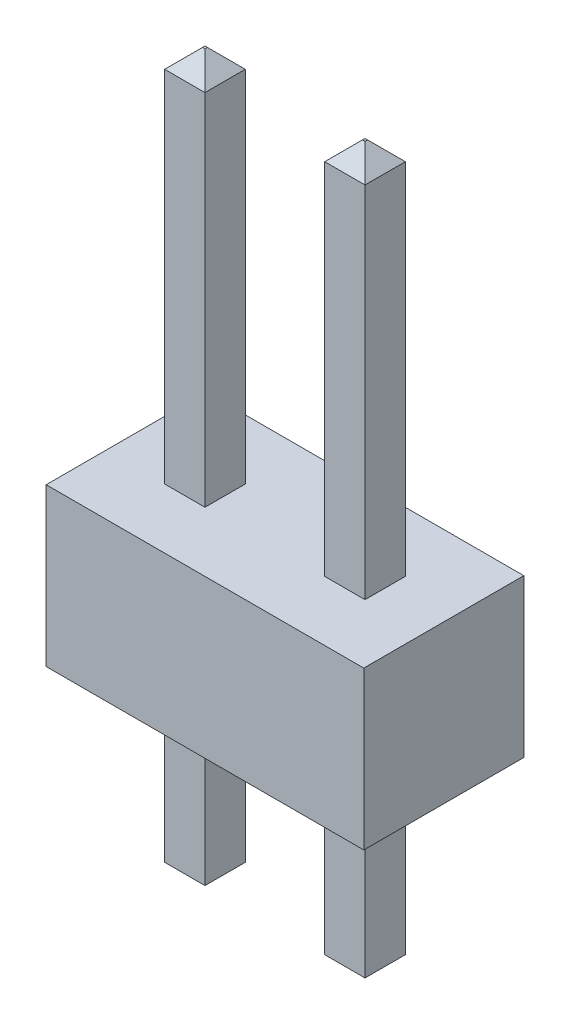
ISO-10303-21;
HEADER;
FILE_DESCRIPTION(('STEP AP214'),'2;1');
FILE_NAME('part.step','',(''),(''),'','','');
FILE_SCHEMA(('AUTOMOTIVE_DESIGN { 1 0 10303 214 1 1 1 1 }'));
ENDSEC;
DATA;
#1=APPLICATION_CONTEXT('core data for automotive mechanical design processes');
#2=APPLICATION_PROTOCOL_DEFINITION('international standard','automotive_design',2000,#1);
#3=PRODUCT_CONTEXT('',#1,'mechanical');
#4=PRODUCT('Part','Part','',(#3));
#5=PRODUCT_RELATED_PRODUCT_CATEGORY('part','',(#4));
#6=PRODUCT_DEFINITION_FORMATION('','',#4);
#7=PRODUCT_DEFINITION_CONTEXT('part definition',#1,'design');
#8=PRODUCT_DEFINITION('design','',#6,#7);
#9=PRODUCT_DEFINITION_SHAPE('','',#8);
#10=(LENGTH_UNIT() NAMED_UNIT(*) SI_UNIT(.MILLI.,.METRE.));
#11=(NAMED_UNIT(*) PLANE_ANGLE_UNIT() SI_UNIT($,.RADIAN.));
#12=(NAMED_UNIT(*) SI_UNIT($,.STERADIAN.) SOLID_ANGLE_UNIT());
#13=UNCERTAINTY_MEASURE_WITH_UNIT(LENGTH_MEASURE(1.E-05),#10,'distance_accuracy_value','');
#14=(GEOMETRIC_REPRESENTATION_CONTEXT(3) GLOBAL_UNCERTAINTY_ASSIGNED_CONTEXT((#13)) GLOBAL_UNIT_ASSIGNED_CONTEXT((#10,
#11,#12)) REPRESENTATION_CONTEXT('',''));
#15=CARTESIAN_POINT('',(0.,0.,0.));
#16=DIRECTION('',(0.,0.,1.));
#17=DIRECTION('',(1.,0.,0.));
#18=AXIS2_PLACEMENT_3D('',#15,#16,#17);
#19=CARTESIAN_POINT('',(1.23000000000001,-3.,1.59000000000001));
#20=DIRECTION('',(0.707106781186548,0.707106781186548,0.));
#21=DIRECTION('',(-0.707106781186548,0.707106781186548,0.));
#22=AXIS2_PLACEMENT_3D('',#19,#20,#21);
#23=PLANE('',#22);
#24=DIRECTION('',(0.,0.,-1.));
#25=VECTOR('',#24,1.);
#26=CARTESIAN_POINT('',(0.929999999999986,-2.7,0.950000000000006));
#27=LINE('',#26,#25);
#28=CARTESIAN_POINT('',(0.929999999999986,-2.7,1.58999999999998));
#29=VERTEX_POINT('',#28);
#30=CARTESIAN_POINT('',(0.929999999999986,-2.7,0.950000000000006));
#31=VERTEX_POINT('',#30);
#32=EDGE_CURVE('E444',#29,#31,#27,.T.);
#33=ORIENTED_EDGE('',*,*,#32,.T.);
#34=DIRECTION('',(0.577350269189625,-0.577350269189625,0.577350269189627));
#35=VECTOR('',#34,1.);
#36=CARTESIAN_POINT('',(0.929999999999986,-2.7,0.950000000000006));
#37=LINE('',#36,#35);
#38=CARTESIAN_POINT('',(1.22999999999998,-3.,1.24999999999997));
#39=VERTEX_POINT('',#38);
#40=EDGE_CURVE('E213',#31,#39,#37,.T.);
#41=ORIENTED_EDGE('',*,*,#40,.T.);
#42=DIRECTION('',(0.,0.,1.));
#43=VECTOR('',#42,1.);
#44=CARTESIAN_POINT('',(1.23000000000001,-3.,1.59000000000001));
#45=LINE('',#44,#43);
#46=CARTESIAN_POINT('',(1.22999999999998,-3.,1.29000000000004));
#47=VERTEX_POINT('',#46);
#48=EDGE_CURVE('E455',#39,#47,#45,.T.);
#49=ORIENTED_EDGE('',*,*,#48,.T.);
#50=DIRECTION('',(-0.577350269189625,0.577350269189626,0.577350269189627));
#51=VECTOR('',#50,1.);
#52=CARTESIAN_POINT('',(1.22999999999998,-3.,1.29000000000004));
#53=LINE('',#52,#51);
#54=EDGE_CURVE('E449',#47,#29,#53,.T.);
#55=ORIENTED_EDGE('',*,*,#54,.T.);
#56=EDGE_LOOP('',(#33,#41,#49,#55));
#57=FACE_BOUND('',#56,.T.);
#58=ADVANCED_FACE('F32',(#57),#23,.F.);
#59=CARTESIAN_POINT('',(3.77,-3.,1.58999999999998));
#60=DIRECTION('',(0.707106781186548,0.707106781186548,0.));
#61=DIRECTION('',(-0.707106781186548,0.707106781186548,0.));
#62=AXIS2_PLACEMENT_3D('',#59,#60,#61);
#63=PLANE('',#62);
#64=DIRECTION('',(0.,0.,-1.));
#65=VECTOR('',#64,1.);
#66=CARTESIAN_POINT('',(3.46999999999997,-2.7,0.950000000000034));
#67=LINE('',#66,#65);
#68=CARTESIAN_POINT('',(3.47,-2.7,1.59000000000004));
#69=VERTEX_POINT('',#68);
#70=CARTESIAN_POINT('',(3.46999999999997,-2.7,0.950000000000034));
#71=VERTEX_POINT('',#70);
#72=EDGE_CURVE('E423',#69,#71,#67,.T.);
#73=ORIENTED_EDGE('',*,*,#72,.T.);
#74=DIRECTION('',(0.577350269189626,-0.577350269189625,0.577350269189627));
#75=VECTOR('',#74,1.);
#76=CARTESIAN_POINT('',(3.46999999999997,-2.7,0.950000000000034));
#77=LINE('',#76,#75);
#78=CARTESIAN_POINT('',(3.77,-3.,1.24999999999999));
#79=VERTEX_POINT('',#78);
#80=EDGE_CURVE('E438',#71,#79,#77,.T.);
#81=ORIENTED_EDGE('',*,*,#80,.T.);
#82=DIRECTION('',(0.,0.,1.));
#83=VECTOR('',#82,1.);
#84=CARTESIAN_POINT('',(3.77,-3.,1.58999999999998));
#85=LINE('',#84,#83);
#86=CARTESIAN_POINT('',(3.77,-3.,1.29000000000004));
#87=VERTEX_POINT('',#86);
#88=EDGE_CURVE('E442',#79,#87,#85,.T.);
#89=ORIENTED_EDGE('',*,*,#88,.T.);
#90=DIRECTION('',(-0.577350269189626,0.577350269189626,0.577350269189626));
#91=VECTOR('',#90,1.);
#92=CARTESIAN_POINT('',(3.77,-3.,1.29000000000004));
#93=LINE('',#92,#91);
#94=EDGE_CURVE('E429',#87,#69,#93,.T.);
#95=ORIENTED_EDGE('',*,*,#94,.T.);
#96=EDGE_LOOP('',(#73,#81,#89,#95));
#97=FACE_BOUND('',#96,.T.);
#98=ADVANCED_FACE('F484',(#97),#63,.F.);
#99=CARTESIAN_POINT('',(1.56999999999996,-3.,1.25000000000003));
#100=DIRECTION('',(0.,0.707106781186548,0.707106781186547));
#101=DIRECTION('',(0.,-0.707106781186547,0.707106781186548));
#102=AXIS2_PLACEMENT_3D('',#99,#100,#101);
#103=PLANE('',#102);
#104=DIRECTION('',(1.,0.,0.));
#105=VECTOR('',#104,1.);
#106=CARTESIAN_POINT('',(0.929999999999986,-2.7,0.950000000000006));
#107=LINE('',#106,#105);
#108=CARTESIAN_POINT('',(1.56999999999999,-2.7,0.95));
#109=VERTEX_POINT('',#108);
#110=EDGE_CURVE('E411',#31,#109,#107,.T.);
#111=ORIENTED_EDGE('',*,*,#110,.T.);
#112=DIRECTION('',(-0.577350269189627,-0.577350269189626,0.577350269189625));
#113=VECTOR('',#112,1.);
#114=CARTESIAN_POINT('',(1.56999999999999,-2.7,0.95));
#115=LINE('',#114,#113);
#116=CARTESIAN_POINT('',(1.26999999999999,-3.,1.25000000000001));
#117=VERTEX_POINT('',#116);
#118=EDGE_CURVE('E408',#109,#117,#115,.T.);
#119=ORIENTED_EDGE('',*,*,#118,.T.);
#120=DIRECTION('',(1.,0.,0.));
#121=VECTOR('',#120,1.);
#122=CARTESIAN_POINT('',(1.56999999999996,-3.,1.25000000000003));
#123=LINE('',#122,#121);
#124=EDGE_CURVE('E457',#117,#39,#123,.F.);
#125=ORIENTED_EDGE('',*,*,#124,.T.);
#126=ORIENTED_EDGE('',*,*,#40,.F.);
#127=EDGE_LOOP('',(#111,#119,#125,#126));
#128=FACE_BOUND('',#127,.T.);
#129=ADVANCED_FACE('F460',(#128),#103,.F.);
#130=CARTESIAN_POINT('',(1.57000000000002,-3.,1.59000000000004));
#131=DIRECTION('',(0.,1.,0.));
#132=DIRECTION('',(0.,0.,1.));
#133=AXIS2_PLACEMENT_3D('',#130,#131,#132);
#134=PLANE('',#133);
#135=ORIENTED_EDGE('',*,*,#124,.F.);
#136=DIRECTION('',(0.,0.,1.));
#137=VECTOR('',#136,1.);
#138=CARTESIAN_POINT('',(1.26999999999999,-3.,1.58999999999998));
#139=LINE('',#138,#137);
#140=CARTESIAN_POINT('',(1.26999999999999,-3.,1.29000000000005));
#141=VERTEX_POINT('',#140);
#142=EDGE_CURVE('E405',#117,#141,#139,.T.);
#143=ORIENTED_EDGE('',*,*,#142,.T.);
#144=DIRECTION('',(1.,0.,0.));
#145=VECTOR('',#144,1.);
#146=CARTESIAN_POINT('',(1.56999999999999,-3.,1.28999999999999));
#147=LINE('',#146,#145);
#148=EDGE_CURVE('E452',#141,#47,#147,.F.);
#149=ORIENTED_EDGE('',*,*,#148,.T.);
#150=ORIENTED_EDGE('',*,*,#48,.F.);
#151=EDGE_LOOP('',(#135,#143,#149,#150));
#152=FACE_BOUND('',#151,.T.);
#153=ADVANCED_FACE('F463',(#152),#134,.F.);
#154=CARTESIAN_POINT('',(1.56999999999999,-3.,1.28999999999999));
#155=DIRECTION('',(0.,0.707106781186548,-0.707106781186548));
#156=DIRECTION('',(0.,0.707106781186548,0.707106781186548));
#157=AXIS2_PLACEMENT_3D('',#154,#155,#156);
#158=PLANE('',#157);
#159=DIRECTION('',(-1.,0.,0.));
#160=VECTOR('',#159,1.);
#161=CARTESIAN_POINT('',(0.929999999999986,-2.7,1.58999999999998));
#162=LINE('',#161,#160);
#163=CARTESIAN_POINT('',(1.57000000000002,-2.7,1.59000000000004));
#164=VERTEX_POINT('',#163);
#165=EDGE_CURVE('E397',#164,#29,#162,.T.);
#166=ORIENTED_EDGE('',*,*,#165,.T.);
#167=ORIENTED_EDGE('',*,*,#54,.F.);
#168=ORIENTED_EDGE('',*,*,#148,.F.);
#169=DIRECTION('',(0.577350269189626,0.577350269189626,0.577350269189627));
#170=VECTOR('',#169,1.);
#171=CARTESIAN_POINT('',(1.26999999999999,-3.,1.29000000000005));
#172=LINE('',#171,#170);
#173=EDGE_CURVE('E402',#141,#164,#172,.T.);
#174=ORIENTED_EDGE('',*,*,#173,.T.);
#175=EDGE_LOOP('',(#166,#167,#168,#174));
#176=FACE_BOUND('',#175,.T.);
#177=ADVANCED_FACE('F470',(#176),#158,.F.);
#178=CARTESIAN_POINT('',(0.929999999999986,-3.,0.950000000000006));
#179=DIRECTION('',(1.,0.,0.));
#180=DIRECTION('',(0.,0.,-1.));
#181=AXIS2_PLACEMENT_3D('',#178,#179,#180);
#182=PLANE('',#181);
#183=ORIENTED_EDGE('',*,*,#32,.F.);
#184=DIRECTION('',(0.,1.,0.));
#185=VECTOR('',#184,1.);
#186=CARTESIAN_POINT('',(0.929999999999986,-3.,1.58999999999998));
#187=LINE('',#186,#185);
#188=CARTESIAN_POINT('',(0.929999999999986,0.,1.58999999999998));
#189=VERTEX_POINT('',#188);
#190=EDGE_CURVE('E394',#29,#189,#187,.T.);
#191=ORIENTED_EDGE('',*,*,#190,.T.);
#192=DIRECTION('',(0.,0.,-1.));
#193=VECTOR('',#192,1.);
#194=CARTESIAN_POINT('',(0.929999999999986,0.,0.950000000000006));
#195=LINE('',#194,#193);
#196=CARTESIAN_POINT('',(0.929999999999986,0.,0.950000000000006));
#197=VERTEX_POINT('',#196);
#198=EDGE_CURVE('E446',#197,#189,#195,.F.);
#199=ORIENTED_EDGE('',*,*,#198,.F.);
#200=DIRECTION('',(0.,1.,0.));
#201=VECTOR('',#200,1.);
#202=CARTESIAN_POINT('',(0.929999999999986,-3.,0.950000000000006));
#203=LINE('',#202,#201);
#204=EDGE_CURVE('E415',#197,#31,#203,.F.);
#205=ORIENTED_EDGE('',*,*,#204,.T.);
#206=EDGE_LOOP('',(#183,#191,#199,#205));
#207=FACE_BOUND('',#206,.T.);
#208=ADVANCED_FACE('F480',(#207),#182,.F.);
#209=CARTESIAN_POINT('',(4.10999999999997,-3.,1.59000000000001));
#210=DIRECTION('',(0.,1.,0.));
#211=DIRECTION('',(0.,0.,1.));
#212=AXIS2_PLACEMENT_3D('',#209,#210,#211);
#213=PLANE('',#212);
#214=ORIENTED_EDGE('',*,*,#88,.F.);
#215=DIRECTION('',(1.,0.,0.));
#216=VECTOR('',#215,1.);
#217=CARTESIAN_POINT('',(4.11,-3.,1.25000000000002));
#218=LINE('',#217,#216);
#219=CARTESIAN_POINT('',(3.80999999999998,-3.,1.24999999999997));
#220=VERTEX_POINT('',#219);
#221=EDGE_CURVE('E435',#79,#220,#218,.T.);
#222=ORIENTED_EDGE('',*,*,#221,.T.);
#223=DIRECTION('',(0.,0.,1.));
#224=VECTOR('',#223,1.);
#225=CARTESIAN_POINT('',(3.81000000000001,-3.,1.58999999999999));
#226=LINE('',#225,#224);
#227=CARTESIAN_POINT('',(3.80999999999998,-3.,1.28999999999999));
#228=VERTEX_POINT('',#227);
#229=EDGE_CURVE('E380',#220,#228,#226,.T.);
#230=ORIENTED_EDGE('',*,*,#229,.T.);
#231=DIRECTION('',(1.,0.,0.));
#232=VECTOR('',#231,1.);
#233=CARTESIAN_POINT('',(4.11,-3.,1.29000000000003));
#234=LINE('',#233,#232);
#235=EDGE_CURVE('E432',#228,#87,#234,.F.);
#236=ORIENTED_EDGE('',*,*,#235,.T.);
#237=EDGE_LOOP('',(#214,#222,#230,#236));
#238=FACE_BOUND('',#237,.T.);
#239=ADVANCED_FACE('F620',(#238),#213,.F.);
#240=CARTESIAN_POINT('',(4.11,-3.,1.25000000000002));
#241=DIRECTION('',(0.,0.707106781186548,0.707106781186547));
#242=DIRECTION('',(0.,-0.707106781186547,0.707106781186548));
#243=AXIS2_PLACEMENT_3D('',#240,#241,#242);
#244=PLANE('',#243);
#245=ORIENTED_EDGE('',*,*,#221,.F.);
#246=ORIENTED_EDGE('',*,*,#80,.F.);
#247=DIRECTION('',(1.,0.,0.));
#248=VECTOR('',#247,1.);
#249=CARTESIAN_POINT('',(3.46999999999997,-2.7,0.950000000000034));
#250=LINE('',#249,#248);
#251=CARTESIAN_POINT('',(4.11,-2.7,0.949999999999979));
#252=VERTEX_POINT('',#251);
#253=EDGE_CURVE('E383',#71,#252,#250,.T.);
#254=ORIENTED_EDGE('',*,*,#253,.T.);
#255=DIRECTION('',(-0.577350269189627,-0.577350269189627,0.577350269189624));
#256=VECTOR('',#255,1.);
#257=CARTESIAN_POINT('',(4.11,-2.7,0.949999999999979));
#258=LINE('',#257,#256);
#259=EDGE_CURVE('E374',#252,#220,#258,.T.);
#260=ORIENTED_EDGE('',*,*,#259,.T.);
#261=EDGE_LOOP('',(#245,#246,#254,#260));
#262=FACE_BOUND('',#261,.T.);
#263=ADVANCED_FACE('F616',(#262),#244,.F.);
#264=CARTESIAN_POINT('',(4.11,-3.,1.29000000000003));
#265=DIRECTION('',(0.,0.707106781186548,-0.707106781186548));
#266=DIRECTION('',(0.,0.707106781186548,0.707106781186548));
#267=AXIS2_PLACEMENT_3D('',#264,#265,#266);
#268=PLANE('',#267);
#269=DIRECTION('',(-1.,0.,0.));
#270=VECTOR('',#269,1.);
#271=CARTESIAN_POINT('',(3.47,-2.7,1.59000000000004));
#272=LINE('',#271,#270);
#273=CARTESIAN_POINT('',(4.10999999999997,-2.7,1.59000000000001));
#274=VERTEX_POINT('',#273);
#275=EDGE_CURVE('E368',#274,#69,#272,.T.);
#276=ORIENTED_EDGE('',*,*,#275,.T.);
#277=ORIENTED_EDGE('',*,*,#94,.F.);
#278=ORIENTED_EDGE('',*,*,#235,.F.);
#279=DIRECTION('',(0.577350269189626,0.577350269189626,0.577350269189625));
#280=VECTOR('',#279,1.);
#281=CARTESIAN_POINT('',(3.80999999999998,-3.,1.28999999999999));
#282=LINE('',#281,#280);
#283=EDGE_CURVE('E377',#228,#274,#282,.T.);
#284=ORIENTED_EDGE('',*,*,#283,.T.);
#285=EDGE_LOOP('',(#276,#277,#278,#284));
#286=FACE_BOUND('',#285,.T.);
#287=ADVANCED_FACE('F612',(#286),#268,.F.);
#288=CARTESIAN_POINT('',(3.46999999999997,-3.,0.950000000000034));
#289=DIRECTION('',(1.,0.,0.));
#290=DIRECTION('',(0.,0.,-1.));
#291=AXIS2_PLACEMENT_3D('',#288,#289,#290);
#292=PLANE('',#291);
#293=ORIENTED_EDGE('',*,*,#72,.F.);
#294=DIRECTION('',(0.,1.,0.));
#295=VECTOR('',#294,1.);
#296=CARTESIAN_POINT('',(3.47,-3.,1.59000000000004));
#297=LINE('',#296,#295);
#298=CARTESIAN_POINT('',(3.47,0.,1.59000000000004));
#299=VERTEX_POINT('',#298);
#300=EDGE_CURVE('E364',#69,#299,#297,.T.);
#301=ORIENTED_EDGE('',*,*,#300,.T.);
#302=DIRECTION('',(0.,0.,-1.));
#303=VECTOR('',#302,1.);
#304=CARTESIAN_POINT('',(3.46999999999997,0.,0.950000000000034));
#305=LINE('',#304,#303);
#306=CARTESIAN_POINT('',(3.46999999999997,0.,0.950000000000034));
#307=VERTEX_POINT('',#306);
#308=EDGE_CURVE('E426',#307,#299,#305,.F.);
#309=ORIENTED_EDGE('',*,*,#308,.F.);
#310=DIRECTION('',(0.,1.,0.));
#311=VECTOR('',#310,1.);
#312=CARTESIAN_POINT('',(3.46999999999997,-3.,0.950000000000034));
#313=LINE('',#312,#311);
#314=EDGE_CURVE('E387',#307,#71,#313,.F.);
#315=ORIENTED_EDGE('',*,*,#314,.T.);
#316=EDGE_LOOP('',(#293,#301,#309,#315));
#317=FACE_BOUND('',#316,.T.);
#318=ADVANCED_FACE('F608',(#317),#292,.F.);
#319=CARTESIAN_POINT('',(0.929999999999986,-3.,0.950000000000006));
#320=DIRECTION('',(0.,0.,1.));
#321=DIRECTION('',(1.,0.,0.));
#322=AXIS2_PLACEMENT_3D('',#319,#320,#321);
#323=PLANE('',#322);
#324=ORIENTED_EDGE('',*,*,#110,.F.);
#325=ORIENTED_EDGE('',*,*,#204,.F.);
#326=DIRECTION('',(1.,0.,0.));
#327=VECTOR('',#326,1.);
#328=CARTESIAN_POINT('',(0.929999999999986,0.,0.950000000000006));
#329=LINE('',#328,#327);
#330=CARTESIAN_POINT('',(1.56999999999999,0.,0.95));
#331=VERTEX_POINT('',#330);
#332=EDGE_CURVE('E419',#331,#197,#329,.F.);
#333=ORIENTED_EDGE('',*,*,#332,.F.);
#334=DIRECTION('',(0.,1.,0.));
#335=VECTOR('',#334,1.);
#336=CARTESIAN_POINT('',(1.56999999999999,-3.,0.95));
#337=LINE('',#336,#335);
#338=EDGE_CURVE('E360',#331,#109,#337,.F.);
#339=ORIENTED_EDGE('',*,*,#338,.T.);
#340=EDGE_LOOP('',(#324,#325,#333,#339));
#341=FACE_BOUND('',#340,.T.);
#342=ADVANCED_FACE('F605',(#341),#323,.F.);
#343=CARTESIAN_POINT('',(1.26999999999999,-3.,1.58999999999998));
#344=DIRECTION('',(-0.707106781186548,0.707106781186548,0.));
#345=DIRECTION('',(-0.707106781186548,-0.707106781186548,0.));
#346=AXIS2_PLACEMENT_3D('',#343,#344,#345);
#347=PLANE('',#346);
#348=ORIENTED_EDGE('',*,*,#142,.F.);
#349=ORIENTED_EDGE('',*,*,#118,.F.);
#350=DIRECTION('',(0.,0.,1.));
#351=VECTOR('',#350,1.);
#352=CARTESIAN_POINT('',(1.56999999999999,-2.7,0.95));
#353=LINE('',#352,#351);
#354=EDGE_CURVE('E357',#109,#164,#353,.T.);
#355=ORIENTED_EDGE('',*,*,#354,.T.);
#356=ORIENTED_EDGE('',*,*,#173,.F.);
#357=EDGE_LOOP('',(#348,#349,#355,#356));
#358=FACE_BOUND('',#357,.T.);
#359=ADVANCED_FACE('F466',(#358),#347,.F.);
#360=CARTESIAN_POINT('',(0.929999999999986,-3.,1.58999999999998));
#361=DIRECTION('',(0.,0.,-1.));
#362=DIRECTION('',(-1.,0.,0.));
#363=AXIS2_PLACEMENT_3D('',#360,#361,#362);
#364=PLANE('',#363);
#365=ORIENTED_EDGE('',*,*,#165,.F.);
#366=DIRECTION('',(0.,1.,0.));
#367=VECTOR('',#366,1.);
#368=CARTESIAN_POINT('',(1.57000000000002,-3.,1.59000000000004));
#369=LINE('',#368,#367);
#370=CARTESIAN_POINT('',(1.57000000000002,0.,1.59000000000004));
#371=VERTEX_POINT('',#370);
#372=EDGE_CURVE('E354',#164,#371,#369,.T.);
#373=ORIENTED_EDGE('',*,*,#372,.T.);
#374=DIRECTION('',(-1.,0.,0.));
#375=VECTOR('',#374,1.);
#376=CARTESIAN_POINT('',(0.929999999999986,0.,1.58999999999998));
#377=LINE('',#376,#375);
#378=EDGE_CURVE('E400',#189,#371,#377,.F.);
#379=ORIENTED_EDGE('',*,*,#378,.F.);
#380=ORIENTED_EDGE('',*,*,#190,.F.);
#381=EDGE_LOOP('',(#365,#373,#379,#380));
#382=FACE_BOUND('',#381,.T.);
#383=ADVANCED_FACE('F477',(#382),#364,.F.);
#384=CARTESIAN_POINT('',(3.46999999999997,-3.,0.950000000000034));
#385=DIRECTION('',(0.,0.,1.));
#386=DIRECTION('',(1.,0.,0.));
#387=AXIS2_PLACEMENT_3D('',#384,#385,#386);
#388=PLANE('',#387);
#389=ORIENTED_EDGE('',*,*,#253,.F.);
#390=ORIENTED_EDGE('',*,*,#314,.F.);
#391=DIRECTION('',(1.,0.,0.));
#392=VECTOR('',#391,1.);
#393=CARTESIAN_POINT('',(3.46999999999997,0.,0.950000000000034));
#394=LINE('',#393,#392);
#395=CARTESIAN_POINT('',(4.11,0.,0.950000000000034));
#396=VERTEX_POINT('',#395);
#397=EDGE_CURVE('E391',#396,#307,#394,.F.);
#398=ORIENTED_EDGE('',*,*,#397,.F.);
#399=DIRECTION('',(0.,1.,0.));
#400=VECTOR('',#399,1.);
#401=CARTESIAN_POINT('',(4.11,-3.,0.949999999999979));
#402=LINE('',#401,#400);
#403=EDGE_CURVE('E350',#396,#252,#402,.F.);
#404=ORIENTED_EDGE('',*,*,#403,.T.);
#405=EDGE_LOOP('',(#389,#390,#398,#404));
#406=FACE_BOUND('',#405,.T.);
#407=ADVANCED_FACE('F596',(#406),#388,.F.);
#408=CARTESIAN_POINT('',(3.81000000000001,-3.,1.58999999999999));
#409=DIRECTION('',(-0.707106781186548,0.707106781186548,0.));
#410=DIRECTION('',(-0.707106781186548,-0.707106781186548,0.));
#411=AXIS2_PLACEMENT_3D('',#408,#409,#410);
#412=PLANE('',#411);
#413=DIRECTION('',(0.,0.,1.));
#414=VECTOR('',#413,1.);
#415=CARTESIAN_POINT('',(4.11,-2.7,0.949999999999979));
#416=LINE('',#415,#414);
#417=EDGE_CURVE('E346',#252,#274,#416,.T.);
#418=ORIENTED_EDGE('',*,*,#417,.T.);
#419=ORIENTED_EDGE('',*,*,#283,.F.);
#420=ORIENTED_EDGE('',*,*,#229,.F.);
#421=ORIENTED_EDGE('',*,*,#259,.F.);
#422=EDGE_LOOP('',(#418,#419,#420,#421));
#423=FACE_BOUND('',#422,.T.);
#424=ADVANCED_FACE('F592',(#423),#412,.F.);
#425=CARTESIAN_POINT('',(3.47,-3.,1.59000000000004));
#426=DIRECTION('',(0.,0.,-1.));
#427=DIRECTION('',(-1.,0.,0.));
#428=AXIS2_PLACEMENT_3D('',#425,#426,#427);
#429=PLANE('',#428);
#430=ORIENTED_EDGE('',*,*,#275,.F.);
#431=DIRECTION('',(0.,1.,0.));
#432=VECTOR('',#431,1.);
#433=CARTESIAN_POINT('',(4.10999999999997,-3.,1.59000000000001));
#434=LINE('',#433,#432);
#435=CARTESIAN_POINT('',(4.10999999999997,0.,1.59000000000001));
#436=VERTEX_POINT('',#435);
#437=EDGE_CURVE('E342',#274,#436,#434,.T.);
#438=ORIENTED_EDGE('',*,*,#437,.T.);
#439=DIRECTION('',(-1.,0.,0.));
#440=VECTOR('',#439,1.);
#441=CARTESIAN_POINT('',(3.47,0.,1.59000000000004));
#442=LINE('',#441,#440);
#443=EDGE_CURVE('E372',#299,#436,#442,.F.);
#444=ORIENTED_EDGE('',*,*,#443,.F.);
#445=ORIENTED_EDGE('',*,*,#300,.F.);
#446=EDGE_LOOP('',(#430,#438,#444,#445));
#447=FACE_BOUND('',#446,.T.);
#448=ADVANCED_FACE('F588',(#447),#429,.F.);
#449=CARTESIAN_POINT('',(1.23000000000001,8.5,1.59000000000001));
#450=DIRECTION('',(-0.707106781186549,0.707106781186546,0.));
#451=DIRECTION('',(-0.707106781186546,-0.707106781186549,0.));
#452=AXIS2_PLACEMENT_3D('',#449,#450,#451);
#453=PLANE('',#452);
#454=DIRECTION('',(-0.577350269189628,-0.577350269189627,0.577350269189624));
#455=VECTOR('',#454,1.);
#456=CARTESIAN_POINT('',(1.22999999999998,8.5,1.29000000000004));
#457=LINE('',#456,#455);
#458=CARTESIAN_POINT('',(1.22999999999998,8.5,1.29000000000004));
#459=VERTEX_POINT('',#458);
#460=CARTESIAN_POINT('',(0.929999999999986,8.2,1.58999999999998));
#461=VERTEX_POINT('',#460);
#462=EDGE_CURVE('E340',#459,#461,#457,.T.);
#463=ORIENTED_EDGE('',*,*,#462,.F.);
#464=DIRECTION('',(0.,0.,1.));
#465=VECTOR('',#464,1.);
#466=CARTESIAN_POINT('',(1.23000000000001,8.5,1.59000000000001));
#467=LINE('',#466,#465);
#468=CARTESIAN_POINT('',(1.22999999999998,8.5,1.24999999999997));
#469=VERTEX_POINT('',#468);
#470=EDGE_CURVE('E335',#469,#459,#467,.T.);
#471=ORIENTED_EDGE('',*,*,#470,.F.);
#472=DIRECTION('',(0.577350269189627,0.577350269189627,0.577350269189624));
#473=VECTOR('',#472,1.);
#474=CARTESIAN_POINT('',(0.929999999999986,8.2,0.950000000000006));
#475=LINE('',#474,#473);
#476=CARTESIAN_POINT('',(0.929999999999986,8.2,0.950000000000006));
#477=VERTEX_POINT('',#476);
#478=EDGE_CURVE('E333',#477,#469,#475,.T.);
#479=ORIENTED_EDGE('',*,*,#478,.F.);
#480=DIRECTION('',(0.,0.,-1.));
#481=VECTOR('',#480,1.);
#482=CARTESIAN_POINT('',(0.929999999999986,8.2,0.950000000000006));
#483=LINE('',#482,#481);
#484=EDGE_CURVE('E324',#477,#461,#483,.F.);
#485=ORIENTED_EDGE('',*,*,#484,.T.);
#486=EDGE_LOOP('',(#463,#471,#479,#485));
#487=FACE_BOUND('',#486,.T.);
#488=ADVANCED_FACE('F584',(#487),#453,.T.);
#489=CARTESIAN_POINT('',(3.77,8.5,1.58999999999998));
#490=DIRECTION('',(-0.70710678118655,0.707106781186545,0.));
#491=DIRECTION('',(-0.707106781186546,-0.70710678118655,0.));
#492=AXIS2_PLACEMENT_3D('',#489,#490,#491);
#493=PLANE('',#492);
#494=DIRECTION('',(-0.577350269189625,-0.577350269189628,0.577350269189625));
#495=VECTOR('',#494,1.);
#496=CARTESIAN_POINT('',(3.77,8.5,1.29000000000004));
#497=LINE('',#496,#495);
#498=CARTESIAN_POINT('',(3.77,8.5,1.29000000000004));
#499=VERTEX_POINT('',#498);
#500=CARTESIAN_POINT('',(3.47,8.2,1.59000000000004));
#501=VERTEX_POINT('',#500);
#502=EDGE_CURVE('E320',#499,#501,#497,.T.);
#503=ORIENTED_EDGE('',*,*,#502,.F.);
#504=DIRECTION('',(0.,0.,1.));
#505=VECTOR('',#504,1.);
#506=CARTESIAN_POINT('',(3.77,8.5,1.58999999999998));
#507=LINE('',#506,#505);
#508=CARTESIAN_POINT('',(3.77,8.5,1.24999999999999));
#509=VERTEX_POINT('',#508);
#510=EDGE_CURVE('E322',#509,#499,#507,.T.);
#511=ORIENTED_EDGE('',*,*,#510,.F.);
#512=DIRECTION('',(0.577350269189625,0.577350269189629,0.577350269189625));
#513=VECTOR('',#512,1.);
#514=CARTESIAN_POINT('',(3.46999999999997,8.2,0.950000000000034));
#515=LINE('',#514,#513);
#516=CARTESIAN_POINT('',(3.46999999999997,8.2,0.950000000000034));
#517=VERTEX_POINT('',#516);
#518=EDGE_CURVE('E315',#517,#509,#515,.T.);
#519=ORIENTED_EDGE('',*,*,#518,.F.);
#520=DIRECTION('',(0.,0.,-1.));
#521=VECTOR('',#520,1.);
#522=CARTESIAN_POINT('',(3.46999999999997,8.2,0.950000000000034));
#523=LINE('',#522,#521);
#524=EDGE_CURVE('E307',#517,#501,#523,.F.);
#525=ORIENTED_EDGE('',*,*,#524,.T.);
#526=EDGE_LOOP('',(#503,#511,#519,#525));
#527=FACE_BOUND('',#526,.T.);
#528=ADVANCED_FACE('F581',(#527),#493,.T.);
#529=CARTESIAN_POINT('',(1.56999999999999,-3.,0.95));
#530=DIRECTION('',(-1.,0.,0.));
#531=DIRECTION('',(0.,0.,1.));
#532=AXIS2_PLACEMENT_3D('',#529,#530,#531);
#533=PLANE('',#532);
#534=ORIENTED_EDGE('',*,*,#354,.F.);
#535=ORIENTED_EDGE('',*,*,#338,.F.);
#536=DIRECTION('',(0.,0.,1.));
#537=VECTOR('',#536,1.);
#538=CARTESIAN_POINT('',(1.56999999999999,0.,7.61999999999999));
#539=LINE('',#538,#537);
#540=EDGE_CURVE('E303',#331,#371,#539,.T.);
#541=ORIENTED_EDGE('',*,*,#540,.T.);
#542=ORIENTED_EDGE('',*,*,#372,.F.);
#543=EDGE_LOOP('',(#534,#535,#541,#542));
#544=FACE_BOUND('',#543,.T.);
#545=ADVANCED_FACE('F473',(#544),#533,.F.);
#546=CARTESIAN_POINT('',(4.11,-3.,0.949999999999979));
#547=DIRECTION('',(-1.,0.,0.));
#548=DIRECTION('',(0.,0.,1.));
#549=AXIS2_PLACEMENT_3D('',#546,#547,#548);
#550=PLANE('',#549);
#551=ORIENTED_EDGE('',*,*,#417,.F.);
#552=ORIENTED_EDGE('',*,*,#403,.F.);
#553=DIRECTION('',(0.,0.,1.));
#554=VECTOR('',#553,1.);
#555=CARTESIAN_POINT('',(4.10999999999997,0.,7.62000000000002));
#556=LINE('',#555,#554);
#557=EDGE_CURVE('E300',#396,#436,#556,.T.);
#558=ORIENTED_EDGE('',*,*,#557,.T.);
#559=ORIENTED_EDGE('',*,*,#437,.F.);
#560=EDGE_LOOP('',(#551,#552,#558,#559));
#561=FACE_BOUND('',#560,.T.);
#562=ADVANCED_FACE('F574',(#561),#550,.F.);
#563=CARTESIAN_POINT('',(1.56999999999999,8.5,1.28999999999999));
#564=DIRECTION('',(0.,0.707106781186545,0.70710678118655));
#565=DIRECTION('',(0.,-0.70710678118655,0.707106781186546));
#566=AXIS2_PLACEMENT_3D('',#563,#564,#565);
#567=PLANE('',#566);
#568=DIRECTION('',(0.577350269189625,-0.577350269189628,0.577350269189625));
#569=VECTOR('',#568,1.);
#570=CARTESIAN_POINT('',(1.26999999999999,8.5,1.29000000000005));
#571=LINE('',#570,#569);
#572=CARTESIAN_POINT('',(1.26999999999999,8.5,1.29000000000005));
#573=VERTEX_POINT('',#572);
#574=CARTESIAN_POINT('',(1.57000000000002,8.2,1.59000000000004));
#575=VERTEX_POINT('',#574);
#576=EDGE_CURVE('E287',#573,#575,#571,.T.);
#577=ORIENTED_EDGE('',*,*,#576,.F.);
#578=DIRECTION('',(1.,0.,0.));
#579=VECTOR('',#578,1.);
#580=CARTESIAN_POINT('',(1.56999999999999,8.5,1.28999999999999));
#581=LINE('',#580,#579);
#582=EDGE_CURVE('E338',#459,#573,#581,.T.);
#583=ORIENTED_EDGE('',*,*,#582,.F.);
#584=ORIENTED_EDGE('',*,*,#462,.T.);
#585=DIRECTION('',(-1.,0.,0.));
#586=VECTOR('',#585,1.);
#587=CARTESIAN_POINT('',(0.929999999999986,8.2,1.58999999999998));
#588=LINE('',#587,#586);
#589=EDGE_CURVE('E289',#461,#575,#588,.F.);
#590=ORIENTED_EDGE('',*,*,#589,.T.);
#591=EDGE_LOOP('',(#577,#583,#584,#590));
#592=FACE_BOUND('',#591,.T.);
#593=ADVANCED_FACE('F570',(#592),#567,.T.);
#594=CARTESIAN_POINT('',(1.57000000000002,8.5,1.59000000000004));
#595=DIRECTION('',(0.,1.,0.));
#596=DIRECTION('',(0.,0.,1.));
#597=AXIS2_PLACEMENT_3D('',#594,#595,#596);
#598=PLANE('',#597);
#599=DIRECTION('',(1.,0.,0.));
#600=VECTOR('',#599,1.);
#601=CARTESIAN_POINT('',(1.56999999999996,8.5,1.25000000000003));
#602=LINE('',#601,#600);
#603=CARTESIAN_POINT('',(1.26999999999999,8.5,1.25000000000001));
#604=VERTEX_POINT('',#603);
#605=EDGE_CURVE('E331',#469,#604,#602,.T.);
#606=ORIENTED_EDGE('',*,*,#605,.F.);
#607=ORIENTED_EDGE('',*,*,#470,.T.);
#608=ORIENTED_EDGE('',*,*,#582,.T.);
#609=DIRECTION('',(0.,0.,1.));
#610=VECTOR('',#609,1.);
#611=CARTESIAN_POINT('',(1.26999999999999,8.5,1.58999999999998));
#612=LINE('',#611,#610);
#613=EDGE_CURVE('E281',#604,#573,#612,.T.);
#614=ORIENTED_EDGE('',*,*,#613,.F.);
#615=EDGE_LOOP('',(#606,#607,#608,#614));
#616=FACE_BOUND('',#615,.T.);
#617=ADVANCED_FACE('F566',(#616),#598,.T.);
#618=CARTESIAN_POINT('',(1.56999999999996,8.5,1.25000000000003));
#619=DIRECTION('',(0.,0.707106781186546,-0.707106781186549));
#620=DIRECTION('',(0.,0.707106781186549,0.707106781186546));
#621=AXIS2_PLACEMENT_3D('',#618,#619,#620);
#622=PLANE('',#621);
#623=DIRECTION('',(-0.577350269189625,0.577350269189628,0.577350269189625));
#624=VECTOR('',#623,1.);
#625=CARTESIAN_POINT('',(1.56999999999999,8.2,0.95));
#626=LINE('',#625,#624);
#627=CARTESIAN_POINT('',(1.56999999999999,8.2,0.95));
#628=VERTEX_POINT('',#627);
#629=EDGE_CURVE('E284',#628,#604,#626,.T.);
#630=ORIENTED_EDGE('',*,*,#629,.F.);
#631=DIRECTION('',(1.,0.,0.));
#632=VECTOR('',#631,1.);
#633=CARTESIAN_POINT('',(0.929999999999986,8.2,0.950000000000006));
#634=LINE('',#633,#632);
#635=EDGE_CURVE('E276',#628,#477,#634,.F.);
#636=ORIENTED_EDGE('',*,*,#635,.T.);
#637=ORIENTED_EDGE('',*,*,#478,.T.);
#638=ORIENTED_EDGE('',*,*,#605,.T.);
#639=EDGE_LOOP('',(#630,#636,#637,#638));
#640=FACE_BOUND('',#639,.T.);
#641=ADVANCED_FACE('F562',(#640),#622,.T.);
#642=CARTESIAN_POINT('',(0.929999999999986,8.5,0.950000000000006));
#643=DIRECTION('',(1.,0.,0.));
#644=DIRECTION('',(0.,0.,-1.));
#645=AXIS2_PLACEMENT_3D('',#642,#643,#644);
#646=PLANE('',#645);
#647=ORIENTED_EDGE('',*,*,#484,.F.);
#648=DIRECTION('',(0.,1.,0.));
#649=VECTOR('',#648,1.);
#650=CARTESIAN_POINT('',(0.929999999999986,8.5,0.950000000000006));
#651=LINE('',#650,#649);
#652=CARTESIAN_POINT('',(0.929999999999986,2.5,0.950000000000006));
#653=VERTEX_POINT('',#652);
#654=EDGE_CURVE('E273',#477,#653,#651,.F.);
#655=ORIENTED_EDGE('',*,*,#654,.T.);
#656=DIRECTION('',(0.,0.,-1.));
#657=VECTOR('',#656,1.);
#658=CARTESIAN_POINT('',(0.929999999999986,2.5,0.950000000000006));
#659=LINE('',#658,#657);
#660=CARTESIAN_POINT('',(0.929999999999986,2.5,1.58999999999998));
#661=VERTEX_POINT('',#660);
#662=EDGE_CURVE('E327',#661,#653,#659,.T.);
#663=ORIENTED_EDGE('',*,*,#662,.F.);
#664=DIRECTION('',(0.,1.,0.));
#665=VECTOR('',#664,1.);
#666=CARTESIAN_POINT('',(0.929999999999986,8.5,1.58999999999998));
#667=LINE('',#666,#665);
#668=EDGE_CURVE('E292',#661,#461,#667,.T.);
#669=ORIENTED_EDGE('',*,*,#668,.T.);
#670=EDGE_LOOP('',(#647,#655,#663,#669));
#671=FACE_BOUND('',#670,.T.);
#672=ADVANCED_FACE('F558',(#671),#646,.F.);
#673=CARTESIAN_POINT('',(4.10999999999997,8.5,1.59000000000001));
#674=DIRECTION('',(0.,1.,0.));
#675=DIRECTION('',(0.,0.,1.));
#676=AXIS2_PLACEMENT_3D('',#673,#674,#675);
#677=PLANE('',#676);
#678=DIRECTION('',(0.,0.,1.));
#679=VECTOR('',#678,1.);
#680=CARTESIAN_POINT('',(3.81000000000001,8.5,1.58999999999999));
#681=LINE('',#680,#679);
#682=CARTESIAN_POINT('',(3.80999999999998,8.5,1.24999999999997));
#683=VERTEX_POINT('',#682);
#684=CARTESIAN_POINT('',(3.80999999999998,8.5,1.28999999999999));
#685=VERTEX_POINT('',#684);
#686=EDGE_CURVE('E260',#683,#685,#681,.T.);
#687=ORIENTED_EDGE('',*,*,#686,.F.);
#688=DIRECTION('',(1.,0.,0.));
#689=VECTOR('',#688,1.);
#690=CARTESIAN_POINT('',(4.11,8.5,1.25000000000002));
#691=LINE('',#690,#689);
#692=EDGE_CURVE('E313',#509,#683,#691,.T.);
#693=ORIENTED_EDGE('',*,*,#692,.F.);
#694=ORIENTED_EDGE('',*,*,#510,.T.);
#695=DIRECTION('',(1.,0.,0.));
#696=VECTOR('',#695,1.);
#697=CARTESIAN_POINT('',(4.11,8.5,1.29000000000003));
#698=LINE('',#697,#696);
#699=EDGE_CURVE('E317',#685,#499,#698,.F.);
#700=ORIENTED_EDGE('',*,*,#699,.F.);
#701=EDGE_LOOP('',(#687,#693,#694,#700));
#702=FACE_BOUND('',#701,.T.);
#703=ADVANCED_FACE('F554',(#702),#677,.T.);
#704=CARTESIAN_POINT('',(4.11,8.5,1.29000000000003));
#705=DIRECTION('',(0.,0.707106781186545,0.70710678118655));
#706=DIRECTION('',(0.,-0.70710678118655,0.707106781186546));
#707=AXIS2_PLACEMENT_3D('',#704,#705,#706);
#708=PLANE('',#707);
#709=DIRECTION('',(0.577350269189625,-0.577350269189628,0.577350269189625));
#710=VECTOR('',#709,1.);
#711=CARTESIAN_POINT('',(3.80999999999998,8.5,1.28999999999999));
#712=LINE('',#711,#710);
#713=CARTESIAN_POINT('',(4.10999999999997,8.2,1.59000000000001));
#714=VERTEX_POINT('',#713);
#715=EDGE_CURVE('E258',#685,#714,#712,.T.);
#716=ORIENTED_EDGE('',*,*,#715,.F.);
#717=ORIENTED_EDGE('',*,*,#699,.T.);
#718=ORIENTED_EDGE('',*,*,#502,.T.);
#719=DIRECTION('',(-1.,0.,0.));
#720=VECTOR('',#719,1.);
#721=CARTESIAN_POINT('',(3.47,8.2,1.59000000000004));
#722=LINE('',#721,#720);
#723=EDGE_CURVE('E265',#501,#714,#722,.F.);
#724=ORIENTED_EDGE('',*,*,#723,.T.);
#725=EDGE_LOOP('',(#716,#717,#718,#724));
#726=FACE_BOUND('',#725,.T.);
#727=ADVANCED_FACE('F550',(#726),#708,.T.);
#728=CARTESIAN_POINT('',(4.11,8.5,1.25000000000002));
#729=DIRECTION('',(0.,0.707106781186545,-0.70710678118655));
#730=DIRECTION('',(0.,0.70710678118655,0.707106781186545));
#731=AXIS2_PLACEMENT_3D('',#728,#729,#730);
#732=PLANE('',#731);
#733=ORIENTED_EDGE('',*,*,#518,.T.);
#734=ORIENTED_EDGE('',*,*,#692,.T.);
#735=DIRECTION('',(-0.577350269189625,0.577350269189628,0.577350269189625));
#736=VECTOR('',#735,1.);
#737=CARTESIAN_POINT('',(4.11,8.2,0.950000000000034));
#738=LINE('',#737,#736);
#739=CARTESIAN_POINT('',(4.11,8.2,0.950000000000034));
#740=VERTEX_POINT('',#739);
#741=EDGE_CURVE('E262',#740,#683,#738,.T.);
#742=ORIENTED_EDGE('',*,*,#741,.F.);
#743=DIRECTION('',(1.,0.,0.));
#744=VECTOR('',#743,1.);
#745=CARTESIAN_POINT('',(3.46999999999997,8.2,0.950000000000034));
#746=LINE('',#745,#744);
#747=EDGE_CURVE('E249',#740,#517,#746,.F.);
#748=ORIENTED_EDGE('',*,*,#747,.T.);
#749=EDGE_LOOP('',(#733,#734,#742,#748));
#750=FACE_BOUND('',#749,.T.);
#751=ADVANCED_FACE('F546',(#750),#732,.T.);
#752=CARTESIAN_POINT('',(3.46999999999997,8.5,0.950000000000034));
#753=DIRECTION('',(1.,0.,0.));
#754=DIRECTION('',(0.,0.,-1.));
#755=AXIS2_PLACEMENT_3D('',#752,#753,#754);
#756=PLANE('',#755);
#757=ORIENTED_EDGE('',*,*,#524,.F.);
#758=DIRECTION('',(0.,1.,0.));
#759=VECTOR('',#758,1.);
#760=CARTESIAN_POINT('',(3.46999999999997,8.5,0.950000000000034));
#761=LINE('',#760,#759);
#762=CARTESIAN_POINT('',(3.46999999999997,2.5,0.950000000000034));
#763=VERTEX_POINT('',#762);
#764=EDGE_CURVE('E243',#517,#763,#761,.F.);
#765=ORIENTED_EDGE('',*,*,#764,.T.);
#766=DIRECTION('',(0.,0.,-1.));
#767=VECTOR('',#766,1.);
#768=CARTESIAN_POINT('',(3.46999999999997,2.5,0.950000000000034));
#769=LINE('',#768,#767);
#770=CARTESIAN_POINT('',(3.47,2.5,1.59000000000004));
#771=VERTEX_POINT('',#770);
#772=EDGE_CURVE('E310',#771,#763,#769,.T.);
#773=ORIENTED_EDGE('',*,*,#772,.F.);
#774=DIRECTION('',(0.,1.,0.));
#775=VECTOR('',#774,1.);
#776=CARTESIAN_POINT('',(3.47,8.5,1.59000000000004));
#777=LINE('',#776,#775);
#778=EDGE_CURVE('E268',#771,#501,#777,.T.);
#779=ORIENTED_EDGE('',*,*,#778,.T.);
#780=EDGE_LOOP('',(#757,#765,#773,#779));
#781=FACE_BOUND('',#780,.T.);
#782=ADVANCED_FACE('F542',(#781),#756,.F.);
#783=CARTESIAN_POINT('',(0.,0.,7.62000000000002));
#784=DIRECTION('',(0.,1.,0.));
#785=DIRECTION('',(0.,0.,1.));
#786=AXIS2_PLACEMENT_3D('',#783,#784,#785);
#787=PLANE('',#786);
#788=ORIENTED_EDGE('',*,*,#397,.T.);
#789=ORIENTED_EDGE('',*,*,#308,.T.);
#790=ORIENTED_EDGE('',*,*,#443,.T.);
#791=ORIENTED_EDGE('',*,*,#557,.F.);
#792=EDGE_LOOP('',(#788,#789,#790,#791));
#793=FACE_BOUND('',#792,.T.);
#794=ORIENTED_EDGE('',*,*,#332,.T.);
#795=ORIENTED_EDGE('',*,*,#198,.T.);
#796=ORIENTED_EDGE('',*,*,#378,.T.);
#797=ORIENTED_EDGE('',*,*,#540,.F.);
#798=EDGE_LOOP('',(#794,#795,#796,#797));
#799=FACE_BOUND('',#798,.T.);
#800=DIRECTION('',(0.,0.,1.));
#801=VECTOR('',#800,1.);
#802=CARTESIAN_POINT('',(5.04000000000002,0.,7.62000000000002));
#803=LINE('',#802,#801);
#804=CARTESIAN_POINT('',(5.03999999999999,0.,0.));
#805=VERTEX_POINT('',#804);
#806=CARTESIAN_POINT('',(5.03999999999999,0.,2.53999999999999));
#807=VERTEX_POINT('',#806);
#808=EDGE_CURVE('E233',#805,#807,#803,.T.);
#809=ORIENTED_EDGE('',*,*,#808,.T.);
#810=DIRECTION('',(-1.,0.,0.));
#811=VECTOR('',#810,1.);
#812=CARTESIAN_POINT('',(0.,0.,2.54000000000002));
#813=LINE('',#812,#811);
#814=CARTESIAN_POINT('',(0.,0.,2.54000000000002));
#815=VERTEX_POINT('',#814);
#816=EDGE_CURVE('E222',#807,#815,#813,.T.);
#817=ORIENTED_EDGE('',*,*,#816,.T.);
#818=DIRECTION('',(0.,0.,1.));
#819=VECTOR('',#818,1.);
#820=CARTESIAN_POINT('',(0.,0.,7.62000000000002));
#821=LINE('',#820,#819);
#822=CARTESIAN_POINT('',(0.,0.,0.));
#823=VERTEX_POINT('',#822);
#824=EDGE_CURVE('E242',#815,#823,#821,.F.);
#825=ORIENTED_EDGE('',*,*,#824,.T.);
#826=DIRECTION('',(-1.,0.,0.));
#827=VECTOR('',#826,1.);
#828=CARTESIAN_POINT('',(0.,0.,0.));
#829=LINE('',#828,#827);
#830=EDGE_CURVE('E241',#805,#823,#829,.T.);
#831=ORIENTED_EDGE('',*,*,#830,.F.);
#832=EDGE_LOOP('',(#809,#817,#825,#831));
#833=FACE_BOUND('',#832,.T.);
#834=ADVANCED_FACE('F239',(#793,#799,#833),#787,.F.);
#835=CARTESIAN_POINT('',(0.929999999999986,8.5,1.58999999999998));
#836=DIRECTION('',(0.,0.,-1.));
#837=DIRECTION('',(-1.,0.,0.));
#838=AXIS2_PLACEMENT_3D('',#835,#836,#837);
#839=PLANE('',#838);
#840=ORIENTED_EDGE('',*,*,#589,.F.);
#841=ORIENTED_EDGE('',*,*,#668,.F.);
#842=DIRECTION('',(-1.,0.,0.));
#843=VECTOR('',#842,1.);
#844=CARTESIAN_POINT('',(0.929999999999986,2.5,1.58999999999998));
#845=LINE('',#844,#843);
#846=CARTESIAN_POINT('',(1.57000000000002,2.5,1.59000000000004));
#847=VERTEX_POINT('',#846);
#848=EDGE_CURVE('E296',#847,#661,#845,.T.);
#849=ORIENTED_EDGE('',*,*,#848,.F.);
#850=DIRECTION('',(0.,1.,0.));
#851=VECTOR('',#850,1.);
#852=CARTESIAN_POINT('',(1.57000000000002,8.5,1.59000000000004));
#853=LINE('',#852,#851);
#854=EDGE_CURVE('E1011',#847,#575,#853,.T.);
#855=ORIENTED_EDGE('',*,*,#854,.T.);
#856=EDGE_LOOP('',(#840,#841,#849,#855));
#857=FACE_BOUND('',#856,.T.);
#858=ADVANCED_FACE('F535',(#857),#839,.F.);
#859=CARTESIAN_POINT('',(1.26999999999999,8.5,1.58999999999998));
#860=DIRECTION('',(0.70710678118655,0.707106781186545,0.));
#861=DIRECTION('',(-0.707106781186546,0.70710678118655,0.));
#862=AXIS2_PLACEMENT_3D('',#859,#860,#861);
#863=PLANE('',#862);
#864=ORIENTED_EDGE('',*,*,#629,.T.);
#865=ORIENTED_EDGE('',*,*,#613,.T.);
#866=ORIENTED_EDGE('',*,*,#576,.T.);
#867=DIRECTION('',(0.,0.,1.));
#868=VECTOR('',#867,1.);
#869=CARTESIAN_POINT('',(1.56999999999999,8.2,0.95));
#870=LINE('',#869,#868);
#871=EDGE_CURVE('E1050',#575,#628,#870,.F.);
#872=ORIENTED_EDGE('',*,*,#871,.T.);
#873=EDGE_LOOP('',(#864,#865,#866,#872));
#874=FACE_BOUND('',#873,.T.);
#875=ADVANCED_FACE('F531',(#874),#863,.T.);
#876=CARTESIAN_POINT('',(0.929999999999986,8.5,0.950000000000006));
#877=DIRECTION('',(0.,0.,1.));
#878=DIRECTION('',(1.,0.,0.));
#879=AXIS2_PLACEMENT_3D('',#876,#877,#878);
#880=PLANE('',#879);
#881=ORIENTED_EDGE('',*,*,#635,.F.);
#882=DIRECTION('',(0.,1.,0.));
#883=VECTOR('',#882,1.);
#884=CARTESIAN_POINT('',(1.56999999999999,8.5,0.95));
#885=LINE('',#884,#883);
#886=CARTESIAN_POINT('',(1.56999999999999,2.5,0.95));
#887=VERTEX_POINT('',#886);
#888=EDGE_CURVE('E1056',#628,#887,#885,.F.);
#889=ORIENTED_EDGE('',*,*,#888,.T.);
#890=DIRECTION('',(1.,0.,0.));
#891=VECTOR('',#890,1.);
#892=CARTESIAN_POINT('',(0.929999999999986,2.5,0.950000000000006));
#893=LINE('',#892,#891);
#894=EDGE_CURVE('E279',#653,#887,#893,.T.);
#895=ORIENTED_EDGE('',*,*,#894,.F.);
#896=ORIENTED_EDGE('',*,*,#654,.F.);
#897=EDGE_LOOP('',(#881,#889,#895,#896));
#898=FACE_BOUND('',#897,.T.);
#899=ADVANCED_FACE('F528',(#898),#880,.F.);
#900=CARTESIAN_POINT('',(3.47,8.5,1.59000000000004));
#901=DIRECTION('',(0.,0.,-1.));
#902=DIRECTION('',(-1.,0.,0.));
#903=AXIS2_PLACEMENT_3D('',#900,#901,#902);
#904=PLANE('',#903);
#905=ORIENTED_EDGE('',*,*,#723,.F.);
#906=ORIENTED_EDGE('',*,*,#778,.F.);
#907=DIRECTION('',(-1.,0.,0.));
#908=VECTOR('',#907,1.);
#909=CARTESIAN_POINT('',(3.47,2.5,1.59000000000004));
#910=LINE('',#909,#908);
#911=CARTESIAN_POINT('',(4.10999999999997,2.5,1.59000000000001));
#912=VERTEX_POINT('',#911);
#913=EDGE_CURVE('E55',#912,#771,#910,.T.);
#914=ORIENTED_EDGE('',*,*,#913,.F.);
#915=DIRECTION('',(0.,1.,0.));
#916=VECTOR('',#915,1.);
#917=CARTESIAN_POINT('',(4.10999999999997,8.5,1.59000000000001));
#918=LINE('',#917,#916);
#919=EDGE_CURVE('E1054',#912,#714,#918,.T.);
#920=ORIENTED_EDGE('',*,*,#919,.T.);
#921=EDGE_LOOP('',(#905,#906,#914,#920));
#922=FACE_BOUND('',#921,.T.);
#923=ADVANCED_FACE('F524',(#922),#904,.F.);
#924=CARTESIAN_POINT('',(3.81000000000001,8.5,1.58999999999999));
#925=DIRECTION('',(0.70710678118655,0.707106781186545,0.));
#926=DIRECTION('',(-0.707106781186546,0.70710678118655,0.));
#927=AXIS2_PLACEMENT_3D('',#924,#925,#926);
#928=PLANE('',#927);
#929=ORIENTED_EDGE('',*,*,#715,.T.);
#930=DIRECTION('',(0.,0.,1.));
#931=VECTOR('',#930,1.);
#932=CARTESIAN_POINT('',(4.11,8.2,0.950000000000034));
#933=LINE('',#932,#931);
#934=EDGE_CURVE('E1046',#714,#740,#933,.F.);
#935=ORIENTED_EDGE('',*,*,#934,.T.);
#936=ORIENTED_EDGE('',*,*,#741,.T.);
#937=ORIENTED_EDGE('',*,*,#686,.T.);
#938=EDGE_LOOP('',(#929,#935,#936,#937));
#939=FACE_BOUND('',#938,.T.);
#940=ADVANCED_FACE('F520',(#939),#928,.T.);
#941=CARTESIAN_POINT('',(3.46999999999997,8.5,0.950000000000034));
#942=DIRECTION('',(0.,0.,1.));
#943=DIRECTION('',(1.,0.,0.));
#944=AXIS2_PLACEMENT_3D('',#941,#942,#943);
#945=PLANE('',#944);
#946=ORIENTED_EDGE('',*,*,#747,.F.);
#947=DIRECTION('',(0.,1.,0.));
#948=VECTOR('',#947,1.);
#949=CARTESIAN_POINT('',(4.11,8.5,0.950000000000034));
#950=LINE('',#949,#948);
#951=CARTESIAN_POINT('',(4.11,2.5,0.950000000000034));
#952=VERTEX_POINT('',#951);
#953=EDGE_CURVE('E1039',#740,#952,#950,.F.);
#954=ORIENTED_EDGE('',*,*,#953,.T.);
#955=DIRECTION('',(1.,0.,0.));
#956=VECTOR('',#955,1.);
#957=CARTESIAN_POINT('',(3.46999999999997,2.5,0.950000000000034));
#958=LINE('',#957,#956);
#959=EDGE_CURVE('E256',#763,#952,#958,.T.);
#960=ORIENTED_EDGE('',*,*,#959,.F.);
#961=ORIENTED_EDGE('',*,*,#764,.F.);
#962=EDGE_LOOP('',(#946,#954,#960,#961));
#963=FACE_BOUND('',#962,.T.);
#964=ADVANCED_FACE('F517',(#963),#945,.F.);
#965=CARTESIAN_POINT('',(5.04000000000002,0.,7.62000000000002));
#966=DIRECTION('',(-1.,0.,0.));
#967=DIRECTION('',(0.,-1.,0.));
#968=AXIS2_PLACEMENT_3D('',#965,#966,#967);
#969=PLANE('',#968);
#970=DIRECTION('',(0.,0.,-1.));
#971=VECTOR('',#970,1.);
#972=CARTESIAN_POINT('',(5.04000000000002,2.5,7.62000000000002));
#973=LINE('',#972,#971);
#974=CARTESIAN_POINT('',(5.03999999999999,2.5,0.));
#975=VERTEX_POINT('',#974);
#976=CARTESIAN_POINT('',(5.03999999999999,2.5,2.53999999999999));
#977=VERTEX_POINT('',#976);
#978=EDGE_CURVE('E235',#975,#977,#973,.F.);
#979=ORIENTED_EDGE('',*,*,#978,.T.);
#980=DIRECTION('',(0.,1.,0.));
#981=VECTOR('',#980,1.);
#982=CARTESIAN_POINT('',(5.03999999999999,-3.,2.53999999999999));
#983=LINE('',#982,#981);
#984=EDGE_CURVE('E47',#807,#977,#983,.T.);
#985=ORIENTED_EDGE('',*,*,#984,.F.);
#986=ORIENTED_EDGE('',*,*,#808,.F.);
#987=DIRECTION('',(0.,1.,0.));
#988=VECTOR('',#987,1.);
#989=CARTESIAN_POINT('',(5.03999999999999,2.5,0.));
#990=LINE('',#989,#988);
#991=EDGE_CURVE('E1012',#975,#805,#990,.F.);
#992=ORIENTED_EDGE('',*,*,#991,.F.);
#993=EDGE_LOOP('',(#979,#985,#986,#992));
#994=FACE_BOUND('',#993,.T.);
#995=ADVANCED_FACE('F231',(#994),#969,.F.);
#996=CARTESIAN_POINT('',(0.,0.,7.62000000000002));
#997=DIRECTION('',(1.,0.,0.));
#998=DIRECTION('',(0.,1.,0.));
#999=AXIS2_PLACEMENT_3D('',#996,#997,#998);
#1000=PLANE('',#999);
#1001=ORIENTED_EDGE('',*,*,#824,.F.);
#1002=DIRECTION('',(0.,1.,0.));
#1003=VECTOR('',#1002,1.);
#1004=CARTESIAN_POINT('',(0.,-3.,2.54000000000002));
#1005=LINE('',#1004,#1003);
#1006=CARTESIAN_POINT('',(0.,2.5,2.54000000000002));
#1007=VERTEX_POINT('',#1006);
#1008=EDGE_CURVE('E219',#815,#1007,#1005,.T.);
#1009=ORIENTED_EDGE('',*,*,#1008,.T.);
#1010=DIRECTION('',(0.,0.,-1.));
#1011=VECTOR('',#1010,1.);
#1012=CARTESIAN_POINT('',(0.,2.5,7.62000000000002));
#1013=LINE('',#1012,#1011);
#1014=CARTESIAN_POINT('',(0.,2.5,0.));
#1015=VERTEX_POINT('',#1014);
#1016=EDGE_CURVE('E1036',#1007,#1015,#1013,.T.);
#1017=ORIENTED_EDGE('',*,*,#1016,.T.);
#1018=DIRECTION('',(0.,1.,0.));
#1019=VECTOR('',#1018,1.);
#1020=CARTESIAN_POINT('',(0.,2.5,0.));
#1021=LINE('',#1020,#1019);
#1022=EDGE_CURVE('E245',#823,#1015,#1021,.T.);
#1023=ORIENTED_EDGE('',*,*,#1022,.F.);
#1024=EDGE_LOOP('',(#1001,#1009,#1017,#1023));
#1025=FACE_BOUND('',#1024,.T.);
#1026=ADVANCED_FACE('F510',(#1025),#1000,.F.);
#1027=CARTESIAN_POINT('',(0.,2.5,0.));
#1028=DIRECTION('',(0.,0.,-1.));
#1029=DIRECTION('',(-1.,0.,0.));
#1030=AXIS2_PLACEMENT_3D('',#1027,#1028,#1029);
#1031=PLANE('',#1030);
#1032=ORIENTED_EDGE('',*,*,#991,.T.);
#1033=ORIENTED_EDGE('',*,*,#830,.T.);
#1034=ORIENTED_EDGE('',*,*,#1022,.T.);
#1035=DIRECTION('',(1.,0.,0.));
#1036=VECTOR('',#1035,1.);
#1037=CARTESIAN_POINT('',(0.,2.5,0.));
#1038=LINE('',#1037,#1036);
#1039=EDGE_CURVE('E1031',#1015,#975,#1038,.T.);
#1040=ORIENTED_EDGE('',*,*,#1039,.T.);
#1041=EDGE_LOOP('',(#1032,#1033,#1034,#1040));
#1042=FACE_BOUND('',#1041,.T.);
#1043=ADVANCED_FACE('F506',(#1042),#1031,.T.);
#1044=CARTESIAN_POINT('',(1.56999999999999,8.5,0.95));
#1045=DIRECTION('',(-1.,0.,0.));
#1046=DIRECTION('',(0.,0.,1.));
#1047=AXIS2_PLACEMENT_3D('',#1044,#1045,#1046);
#1048=PLANE('',#1047);
#1049=ORIENTED_EDGE('',*,*,#871,.F.);
#1050=ORIENTED_EDGE('',*,*,#854,.F.);
#1051=DIRECTION('',(0.,0.,-1.));
#1052=VECTOR('',#1051,1.);
#1053=CARTESIAN_POINT('',(1.56999999999999,2.5,7.61999999999999));
#1054=LINE('',#1053,#1052);
#1055=EDGE_CURVE('E1035',#847,#887,#1054,.T.);
#1056=ORIENTED_EDGE('',*,*,#1055,.T.);
#1057=ORIENTED_EDGE('',*,*,#888,.F.);
#1058=EDGE_LOOP('',(#1049,#1050,#1056,#1057));
#1059=FACE_BOUND('',#1058,.T.);
#1060=ADVANCED_FACE('F499',(#1059),#1048,.F.);
#1061=CARTESIAN_POINT('',(4.11,8.5,0.950000000000034));
#1062=DIRECTION('',(-1.,0.,0.));
#1063=DIRECTION('',(0.,0.,1.));
#1064=AXIS2_PLACEMENT_3D('',#1061,#1062,#1063);
#1065=PLANE('',#1064);
#1066=ORIENTED_EDGE('',*,*,#934,.F.);
#1067=ORIENTED_EDGE('',*,*,#919,.F.);
#1068=DIRECTION('',(0.,0.,-1.));
#1069=VECTOR('',#1068,1.);
#1070=CARTESIAN_POINT('',(4.10999999999997,2.5,7.62000000000002));
#1071=LINE('',#1070,#1069);
#1072=EDGE_CURVE('E40',#912,#952,#1071,.T.);
#1073=ORIENTED_EDGE('',*,*,#1072,.T.);
#1074=ORIENTED_EDGE('',*,*,#953,.F.);
#1075=EDGE_LOOP('',(#1066,#1067,#1073,#1074));
#1076=FACE_BOUND('',#1075,.T.);
#1077=ADVANCED_FACE('F493',(#1076),#1065,.F.);
#1078=CARTESIAN_POINT('',(0.,2.5,7.62000000000002));
#1079=DIRECTION('',(0.,-1.,0.));
#1080=DIRECTION('',(0.,0.,-1.));
#1081=AXIS2_PLACEMENT_3D('',#1078,#1079,#1080);
#1082=PLANE('',#1081);
#1083=ORIENTED_EDGE('',*,*,#913,.T.);
#1084=ORIENTED_EDGE('',*,*,#772,.T.);
#1085=ORIENTED_EDGE('',*,*,#959,.T.);
#1086=ORIENTED_EDGE('',*,*,#1072,.F.);
#1087=EDGE_LOOP('',(#1083,#1084,#1085,#1086));
#1088=FACE_BOUND('',#1087,.T.);
#1089=ORIENTED_EDGE('',*,*,#848,.T.);
#1090=ORIENTED_EDGE('',*,*,#662,.T.);
#1091=ORIENTED_EDGE('',*,*,#894,.T.);
#1092=ORIENTED_EDGE('',*,*,#1055,.F.);
#1093=EDGE_LOOP('',(#1089,#1090,#1091,#1092));
#1094=FACE_BOUND('',#1093,.T.);
#1095=ORIENTED_EDGE('',*,*,#1016,.F.);
#1096=DIRECTION('',(1.,0.,0.));
#1097=VECTOR('',#1096,1.);
#1098=CARTESIAN_POINT('',(0.,2.5,2.54000000000002));
#1099=LINE('',#1098,#1097);
#1100=EDGE_CURVE('E11',#1007,#977,#1099,.T.);
#1101=ORIENTED_EDGE('',*,*,#1100,.T.);
#1102=ORIENTED_EDGE('',*,*,#978,.F.);
#1103=ORIENTED_EDGE('',*,*,#1039,.F.);
#1104=EDGE_LOOP('',(#1095,#1101,#1102,#1103));
#1105=FACE_BOUND('',#1104,.T.);
#1106=ADVANCED_FACE('F490',(#1088,#1094,#1105),#1082,.F.);
#1107=CARTESIAN_POINT('',(0.,-3.,2.54000000000002));
#1108=DIRECTION('',(0.,0.,-1.));
#1109=DIRECTION('',(-1.,0.,0.));
#1110=AXIS2_PLACEMENT_3D('',#1107,#1108,#1109);
#1111=PLANE('',#1110);
#1112=ORIENTED_EDGE('',*,*,#984,.T.);
#1113=ORIENTED_EDGE('',*,*,#1100,.F.);
#1114=ORIENTED_EDGE('',*,*,#1008,.F.);
#1115=ORIENTED_EDGE('',*,*,#816,.F.);
#1116=EDGE_LOOP('',(#1112,#1113,#1114,#1115));
#1117=FACE_BOUND('',#1116,.T.);
#1118=ADVANCED_FACE('F223',(#1117),#1111,.F.);
#1119=CLOSED_SHELL('',(#58,#98,#129,#153,#177,#208,#239,#263,#287,#318,#342,#359,#383,#407,#424,
#448,#488,#528,#545,#562,#593,#617,#641,#672,#703,#727,#751,#782,#834,#858,#875,#899,#923,#940,
#964,#995,#1026,#1043,#1060,#1077,#1106,#1118));
#1120=MANIFOLD_SOLID_BREP('B2',#1119);
#1121=ADVANCED_BREP_SHAPE_REPRESENTATION('',(#18,#1120),#14);
#1122=SHAPE_DEFINITION_REPRESENTATION(#9,#1121);
ENDSEC;
END-ISO-10303-21;
